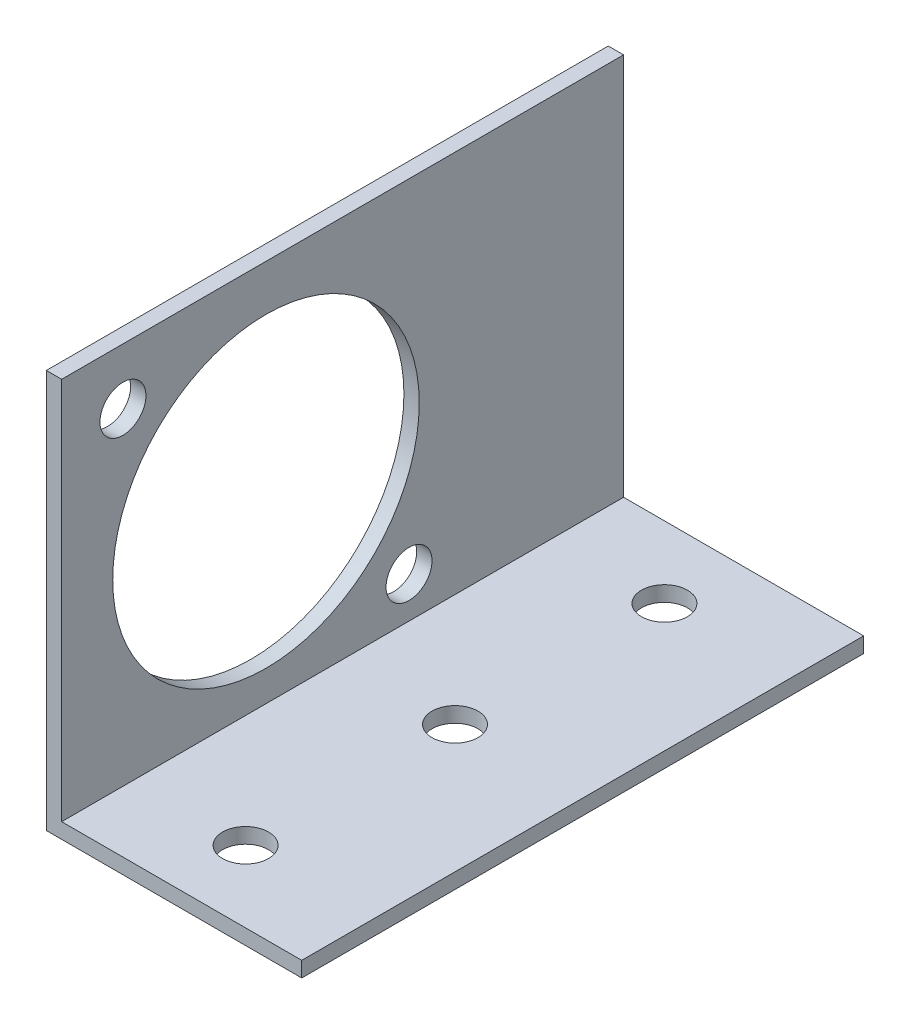
ISO-10303-21;
HEADER;
FILE_DESCRIPTION(('STEP AP214'),'2;1');
FILE_NAME('part.step','',(''),(''),'','','');
FILE_SCHEMA(('AUTOMOTIVE_DESIGN { 1 0 10303 214 1 1 1 1 }'));
ENDSEC;
DATA;
#1=APPLICATION_CONTEXT('core data for automotive mechanical design processes');
#2=APPLICATION_PROTOCOL_DEFINITION('international standard','automotive_design',2000,#1);
#3=PRODUCT_CONTEXT('',#1,'mechanical');
#4=PRODUCT('Part','Part','',(#3));
#5=PRODUCT_RELATED_PRODUCT_CATEGORY('part','',(#4));
#6=PRODUCT_DEFINITION_FORMATION('','',#4);
#7=PRODUCT_DEFINITION_CONTEXT('part definition',#1,'design');
#8=PRODUCT_DEFINITION('design','',#6,#7);
#9=PRODUCT_DEFINITION_SHAPE('','',#8);
#10=(LENGTH_UNIT() NAMED_UNIT(*) SI_UNIT(.MILLI.,.METRE.));
#11=(NAMED_UNIT(*) PLANE_ANGLE_UNIT() SI_UNIT($,.RADIAN.));
#12=(NAMED_UNIT(*) SI_UNIT($,.STERADIAN.) SOLID_ANGLE_UNIT());
#13=UNCERTAINTY_MEASURE_WITH_UNIT(LENGTH_MEASURE(1.E-05),#10,'distance_accuracy_value','');
#14=(GEOMETRIC_REPRESENTATION_CONTEXT(3) GLOBAL_UNCERTAINTY_ASSIGNED_CONTEXT((#13)) GLOBAL_UNIT_ASSIGNED_CONTEXT((#10,
#11,#12)) REPRESENTATION_CONTEXT('',''));
#15=CARTESIAN_POINT('',(0.,0.,0.));
#16=DIRECTION('',(0.,0.,1.));
#17=DIRECTION('',(1.,0.,0.));
#18=AXIS2_PLACEMENT_3D('',#15,#16,#17);
#19=CARTESIAN_POINT('',(1.5,0.,-55.));
#20=DIRECTION('',(1.,0.,0.));
#21=DIRECTION('',(0.,0.,-1.));
#22=AXIS2_PLACEMENT_3D('',#19,#20,#21);
#23=PLANE('',#22);
#24=CARTESIAN_POINT('',(1.5,19.5,-20.));
#25=DIRECTION('',(1.,0.,0.));
#26=DIRECTION('',(0.,0.,-1.));
#27=AXIS2_PLACEMENT_3D('',#24,#25,#26);
#28=CIRCLE('',#27,15.);
#29=CARTESIAN_POINT('',(1.5,19.5,-35.));
#30=VERTEX_POINT('',#29);
#31=EDGE_CURVE('E199',#30,#30,#28,.T.);
#32=ORIENTED_EDGE('',*,*,#31,.F.);
#33=EDGE_LOOP('',(#32));
#34=FACE_BOUND('',#33,.T.);
#35=CARTESIAN_POINT('',(1.5,33.5,-6.));
#36=DIRECTION('',(1.,0.,0.));
#37=DIRECTION('',(0.,0.,-1.));
#38=AXIS2_PLACEMENT_3D('',#35,#36,#37);
#39=CIRCLE('',#38,2.25);
#40=CARTESIAN_POINT('',(1.5,33.5,-8.25));
#41=VERTEX_POINT('',#40);
#42=EDGE_CURVE('E201',#41,#41,#39,.T.);
#43=ORIENTED_EDGE('',*,*,#42,.F.);
#44=EDGE_LOOP('',(#43));
#45=FACE_BOUND('',#44,.T.);
#46=CARTESIAN_POINT('',(1.5,5.5,-34.));
#47=DIRECTION('',(1.,0.,0.));
#48=DIRECTION('',(0.,0.,-1.));
#49=AXIS2_PLACEMENT_3D('',#46,#47,#48);
#50=CIRCLE('',#49,2.25);
#51=CARTESIAN_POINT('',(1.5,5.5,-36.25));
#52=VERTEX_POINT('',#51);
#53=EDGE_CURVE('E209',#52,#52,#50,.T.);
#54=ORIENTED_EDGE('',*,*,#53,.F.);
#55=EDGE_LOOP('',(#54));
#56=FACE_BOUND('',#55,.T.);
#57=DIRECTION('',(0.,1.,0.));
#58=VECTOR('',#57,1.);
#59=CARTESIAN_POINT('',(1.5,0.,0.));
#60=LINE('',#59,#58);
#61=CARTESIAN_POINT('',(1.5,1.5,0.));
#62=VERTEX_POINT('',#61);
#63=CARTESIAN_POINT('',(1.5,39.,0.));
#64=VERTEX_POINT('',#63);
#65=EDGE_CURVE('E113',#62,#64,#60,.T.);
#66=ORIENTED_EDGE('',*,*,#65,.F.);
#67=DIRECTION('',(0.,0.,1.));
#68=VECTOR('',#67,1.);
#69=CARTESIAN_POINT('',(1.5,1.5,-55.));
#70=LINE('',#69,#68);
#71=CARTESIAN_POINT('',(1.5,1.5,-55.));
#72=VERTEX_POINT('',#71);
#73=EDGE_CURVE('E11',#72,#62,#70,.T.);
#74=ORIENTED_EDGE('',*,*,#73,.F.);
#75=DIRECTION('',(0.,1.,0.));
#76=VECTOR('',#75,1.);
#77=CARTESIAN_POINT('',(1.5,0.,-55.));
#78=LINE('',#77,#76);
#79=CARTESIAN_POINT('',(1.5,39.,-55.));
#80=VERTEX_POINT('',#79);
#81=EDGE_CURVE('E127',#72,#80,#78,.T.);
#82=ORIENTED_EDGE('',*,*,#81,.T.);
#83=DIRECTION('',(0.,0.,1.));
#84=VECTOR('',#83,1.);
#85=CARTESIAN_POINT('',(1.5,39.,-55.));
#86=LINE('',#85,#84);
#87=EDGE_CURVE('E34',#80,#64,#86,.T.);
#88=ORIENTED_EDGE('',*,*,#87,.T.);
#89=EDGE_LOOP('',(#66,#74,#82,#88));
#90=FACE_BOUND('',#89,.T.);
#91=ADVANCED_FACE('F31',(#34,#45,#56,#90),#23,.T.);
#92=CARTESIAN_POINT('',(0.,1.5,-55.));
#93=DIRECTION('',(0.,1.,0.));
#94=DIRECTION('',(0.,0.,1.));
#95=AXIS2_PLACEMENT_3D('',#92,#93,#94);
#96=PLANE('',#95);
#97=CARTESIAN_POINT('',(12.5,1.5,-7.));
#98=DIRECTION('',(0.,1.,0.));
#99=DIRECTION('',(0.,0.,1.));
#100=AXIS2_PLACEMENT_3D('',#97,#98,#99);
#101=CIRCLE('',#100,2.25);
#102=CARTESIAN_POINT('',(12.5,1.5,-4.75));
#103=VERTEX_POINT('',#102);
#104=EDGE_CURVE('E215',#103,#103,#101,.T.);
#105=ORIENTED_EDGE('',*,*,#104,.F.);
#106=EDGE_LOOP('',(#105));
#107=FACE_BOUND('',#106,.T.);
#108=CARTESIAN_POINT('',(12.5,1.5,-27.5));
#109=DIRECTION('',(0.,1.,0.));
#110=DIRECTION('',(0.,0.,1.));
#111=AXIS2_PLACEMENT_3D('',#108,#109,#110);
#112=CIRCLE('',#111,2.25);
#113=CARTESIAN_POINT('',(12.5,1.5,-25.25));
#114=VERTEX_POINT('',#113);
#115=EDGE_CURVE('E221',#114,#114,#112,.T.);
#116=ORIENTED_EDGE('',*,*,#115,.F.);
#117=EDGE_LOOP('',(#116));
#118=FACE_BOUND('',#117,.T.);
#119=CARTESIAN_POINT('',(12.5,1.5,-48.));
#120=DIRECTION('',(0.,1.,0.));
#121=DIRECTION('',(0.,0.,1.));
#122=AXIS2_PLACEMENT_3D('',#119,#120,#121);
#123=CIRCLE('',#122,2.25);
#124=CARTESIAN_POINT('',(12.5,1.5,-45.75));
#125=VERTEX_POINT('',#124);
#126=EDGE_CURVE('E227',#125,#125,#123,.T.);
#127=ORIENTED_EDGE('',*,*,#126,.F.);
#128=EDGE_LOOP('',(#127));
#129=FACE_BOUND('',#128,.T.);
#130=DIRECTION('',(1.,0.,0.));
#131=VECTOR('',#130,1.);
#132=CARTESIAN_POINT('',(0.,1.5,0.));
#133=LINE('',#132,#131);
#134=CARTESIAN_POINT('',(25.,1.5,0.));
#135=VERTEX_POINT('',#134);
#136=EDGE_CURVE('E125',#135,#62,#133,.F.);
#137=ORIENTED_EDGE('',*,*,#136,.F.);
#138=DIRECTION('',(0.,0.,1.));
#139=VECTOR('',#138,1.);
#140=CARTESIAN_POINT('',(25.,1.5,-55.));
#141=LINE('',#140,#139);
#142=CARTESIAN_POINT('',(25.,1.5,-55.));
#143=VERTEX_POINT('',#142);
#144=EDGE_CURVE('E40',#143,#135,#141,.T.);
#145=ORIENTED_EDGE('',*,*,#144,.F.);
#146=DIRECTION('',(1.,0.,0.));
#147=VECTOR('',#146,1.);
#148=CARTESIAN_POINT('',(0.,1.5,-55.));
#149=LINE('',#148,#147);
#150=EDGE_CURVE('E94',#143,#72,#149,.F.);
#151=ORIENTED_EDGE('',*,*,#150,.T.);
#152=ORIENTED_EDGE('',*,*,#73,.T.);
#153=EDGE_LOOP('',(#137,#145,#151,#152));
#154=FACE_BOUND('',#153,.T.);
#155=ADVANCED_FACE('F139',(#107,#118,#129,#154),#96,.T.);
#156=CARTESIAN_POINT('',(25.,1.5,-55.));
#157=DIRECTION('',(-1.,0.,0.));
#158=DIRECTION('',(0.,0.,1.));
#159=AXIS2_PLACEMENT_3D('',#156,#157,#158);
#160=PLANE('',#159);
#161=DIRECTION('',(0.,-1.,0.));
#162=VECTOR('',#161,1.);
#163=CARTESIAN_POINT('',(25.,1.5,0.));
#164=LINE('',#163,#162);
#165=CARTESIAN_POINT('',(25.,0.,0.));
#166=VERTEX_POINT('',#165);
#167=EDGE_CURVE('E99',#135,#166,#164,.T.);
#168=ORIENTED_EDGE('',*,*,#167,.T.);
#169=DIRECTION('',(0.,0.,1.));
#170=VECTOR('',#169,1.);
#171=CARTESIAN_POINT('',(25.,0.,-55.));
#172=LINE('',#171,#170);
#173=CARTESIAN_POINT('',(25.,0.,-55.));
#174=VERTEX_POINT('',#173);
#175=EDGE_CURVE('E97',#174,#166,#172,.T.);
#176=ORIENTED_EDGE('',*,*,#175,.F.);
#177=DIRECTION('',(0.,-1.,0.));
#178=VECTOR('',#177,1.);
#179=CARTESIAN_POINT('',(25.,1.5,-55.));
#180=LINE('',#179,#178);
#181=EDGE_CURVE('E88',#143,#174,#180,.T.);
#182=ORIENTED_EDGE('',*,*,#181,.F.);
#183=ORIENTED_EDGE('',*,*,#144,.T.);
#184=EDGE_LOOP('',(#168,#176,#182,#183));
#185=FACE_BOUND('',#184,.T.);
#186=ADVANCED_FACE('F98',(#185),#160,.F.);
#187=CARTESIAN_POINT('',(0.,0.,-55.));
#188=DIRECTION('',(0.,1.,0.));
#189=DIRECTION('',(0.,0.,1.));
#190=AXIS2_PLACEMENT_3D('',#187,#188,#189);
#191=PLANE('',#190);
#192=CARTESIAN_POINT('',(12.5,0.,-7.));
#193=DIRECTION('',(0.,1.,0.));
#194=DIRECTION('',(0.,0.,1.));
#195=AXIS2_PLACEMENT_3D('',#192,#193,#194);
#196=CIRCLE('',#195,2.25);
#197=CARTESIAN_POINT('',(12.5,0.,-4.75));
#198=VERTEX_POINT('',#197);
#199=EDGE_CURVE('E218',#198,#198,#196,.T.);
#200=ORIENTED_EDGE('',*,*,#199,.T.);
#201=EDGE_LOOP('',(#200));
#202=FACE_BOUND('',#201,.T.);
#203=CARTESIAN_POINT('',(12.5,0.,-27.5));
#204=DIRECTION('',(0.,1.,0.));
#205=DIRECTION('',(0.,0.,1.));
#206=AXIS2_PLACEMENT_3D('',#203,#204,#205);
#207=CIRCLE('',#206,2.25);
#208=CARTESIAN_POINT('',(12.5,0.,-25.25));
#209=VERTEX_POINT('',#208);
#210=EDGE_CURVE('E224',#209,#209,#207,.T.);
#211=ORIENTED_EDGE('',*,*,#210,.T.);
#212=EDGE_LOOP('',(#211));
#213=FACE_BOUND('',#212,.T.);
#214=CARTESIAN_POINT('',(12.5,0.,-48.));
#215=DIRECTION('',(0.,1.,0.));
#216=DIRECTION('',(0.,0.,1.));
#217=AXIS2_PLACEMENT_3D('',#214,#215,#216);
#218=CIRCLE('',#217,2.25);
#219=CARTESIAN_POINT('',(12.5,0.,-45.75));
#220=VERTEX_POINT('',#219);
#221=EDGE_CURVE('E117',#220,#220,#218,.T.);
#222=ORIENTED_EDGE('',*,*,#221,.T.);
#223=EDGE_LOOP('',(#222));
#224=FACE_BOUND('',#223,.T.);
#225=DIRECTION('',(-1.,0.,0.));
#226=VECTOR('',#225,1.);
#227=CARTESIAN_POINT('',(0.,0.,0.));
#228=LINE('',#227,#226);
#229=CARTESIAN_POINT('',(0.,0.,0.));
#230=VERTEX_POINT('',#229);
#231=EDGE_CURVE('E122',#166,#230,#228,.T.);
#232=ORIENTED_EDGE('',*,*,#231,.T.);
#233=DIRECTION('',(0.,0.,1.));
#234=VECTOR('',#233,1.);
#235=CARTESIAN_POINT('',(0.,0.,-55.));
#236=LINE('',#235,#234);
#237=CARTESIAN_POINT('',(0.,0.,-55.));
#238=VERTEX_POINT('',#237);
#239=EDGE_CURVE('E102',#238,#230,#236,.T.);
#240=ORIENTED_EDGE('',*,*,#239,.F.);
#241=DIRECTION('',(-1.,0.,0.));
#242=VECTOR('',#241,1.);
#243=CARTESIAN_POINT('',(0.,0.,-55.));
#244=LINE('',#243,#242);
#245=EDGE_CURVE('E92',#174,#238,#244,.T.);
#246=ORIENTED_EDGE('',*,*,#245,.F.);
#247=ORIENTED_EDGE('',*,*,#175,.T.);
#248=EDGE_LOOP('',(#232,#240,#246,#247));
#249=FACE_BOUND('',#248,.T.);
#250=ADVANCED_FACE('F104',(#202,#213,#224,#249),#191,.F.);
#251=CARTESIAN_POINT('',(0.,0.,-55.));
#252=DIRECTION('',(1.,0.,0.));
#253=DIRECTION('',(0.,0.,-1.));
#254=AXIS2_PLACEMENT_3D('',#251,#252,#253);
#255=PLANE('',#254);
#256=CARTESIAN_POINT('',(0.,19.5,-20.));
#257=DIRECTION('',(1.,0.,0.));
#258=DIRECTION('',(0.,0.,-1.));
#259=AXIS2_PLACEMENT_3D('',#256,#257,#258);
#260=CIRCLE('',#259,15.);
#261=CARTESIAN_POINT('',(0.,19.5,-35.));
#262=VERTEX_POINT('',#261);
#263=EDGE_CURVE('E196',#262,#262,#260,.T.);
#264=ORIENTED_EDGE('',*,*,#263,.T.);
#265=EDGE_LOOP('',(#264));
#266=FACE_BOUND('',#265,.T.);
#267=CARTESIAN_POINT('',(0.,33.5,-6.));
#268=DIRECTION('',(1.,0.,0.));
#269=DIRECTION('',(0.,0.,-1.));
#270=AXIS2_PLACEMENT_3D('',#267,#268,#269);
#271=CIRCLE('',#270,2.25);
#272=CARTESIAN_POINT('',(0.,33.5,-8.25));
#273=VERTEX_POINT('',#272);
#274=EDGE_CURVE('E206',#273,#273,#271,.T.);
#275=ORIENTED_EDGE('',*,*,#274,.T.);
#276=EDGE_LOOP('',(#275));
#277=FACE_BOUND('',#276,.T.);
#278=CARTESIAN_POINT('',(0.,5.5,-34.));
#279=DIRECTION('',(1.,0.,0.));
#280=DIRECTION('',(0.,0.,-1.));
#281=AXIS2_PLACEMENT_3D('',#278,#279,#280);
#282=CIRCLE('',#281,2.25);
#283=CARTESIAN_POINT('',(0.,5.5,-36.25));
#284=VERTEX_POINT('',#283);
#285=EDGE_CURVE('E212',#284,#284,#282,.T.);
#286=ORIENTED_EDGE('',*,*,#285,.T.);
#287=EDGE_LOOP('',(#286));
#288=FACE_BOUND('',#287,.T.);
#289=DIRECTION('',(0.,1.,0.));
#290=VECTOR('',#289,1.);
#291=CARTESIAN_POINT('',(0.,0.,0.));
#292=LINE('',#291,#290);
#293=CARTESIAN_POINT('',(0.,39.,0.));
#294=VERTEX_POINT('',#293);
#295=EDGE_CURVE('E120',#230,#294,#292,.T.);
#296=ORIENTED_EDGE('',*,*,#295,.T.);
#297=DIRECTION('',(0.,0.,1.));
#298=VECTOR('',#297,1.);
#299=CARTESIAN_POINT('',(0.,39.,-55.));
#300=LINE('',#299,#298);
#301=CARTESIAN_POINT('',(0.,39.,-55.));
#302=VERTEX_POINT('',#301);
#303=EDGE_CURVE('E130',#302,#294,#300,.T.);
#304=ORIENTED_EDGE('',*,*,#303,.F.);
#305=DIRECTION('',(0.,1.,0.));
#306=VECTOR('',#305,1.);
#307=CARTESIAN_POINT('',(0.,0.,-55.));
#308=LINE('',#307,#306);
#309=EDGE_CURVE('E107',#238,#302,#308,.T.);
#310=ORIENTED_EDGE('',*,*,#309,.F.);
#311=ORIENTED_EDGE('',*,*,#239,.T.);
#312=EDGE_LOOP('',(#296,#304,#310,#311));
#313=FACE_BOUND('',#312,.T.);
#314=ADVANCED_FACE('F156',(#266,#277,#288,#313),#255,.F.);
#315=CARTESIAN_POINT('',(0.,39.,-55.));
#316=DIRECTION('',(0.,-1.,0.));
#317=DIRECTION('',(0.,0.,-1.));
#318=AXIS2_PLACEMENT_3D('',#315,#316,#317);
#319=PLANE('',#318);
#320=DIRECTION('',(1.,0.,0.));
#321=VECTOR('',#320,1.);
#322=CARTESIAN_POINT('',(0.,39.,0.));
#323=LINE('',#322,#321);
#324=EDGE_CURVE('E116',#294,#64,#323,.T.);
#325=ORIENTED_EDGE('',*,*,#324,.T.);
#326=ORIENTED_EDGE('',*,*,#87,.F.);
#327=DIRECTION('',(1.,0.,0.));
#328=VECTOR('',#327,1.);
#329=CARTESIAN_POINT('',(0.,39.,-55.));
#330=LINE('',#329,#328);
#331=EDGE_CURVE('E80',#302,#80,#330,.T.);
#332=ORIENTED_EDGE('',*,*,#331,.F.);
#333=ORIENTED_EDGE('',*,*,#303,.T.);
#334=EDGE_LOOP('',(#325,#326,#332,#333));
#335=FACE_BOUND('',#334,.T.);
#336=ADVANCED_FACE('F135',(#335),#319,.F.);
#337=CARTESIAN_POINT('',(1.5,39.,-55.));
#338=DIRECTION('',(0.,0.,-1.));
#339=DIRECTION('',(-1.,0.,0.));
#340=AXIS2_PLACEMENT_3D('',#337,#338,#339);
#341=PLANE('',#340);
#342=ORIENTED_EDGE('',*,*,#81,.F.);
#343=ORIENTED_EDGE('',*,*,#150,.F.);
#344=ORIENTED_EDGE('',*,*,#181,.T.);
#345=ORIENTED_EDGE('',*,*,#245,.T.);
#346=ORIENTED_EDGE('',*,*,#309,.T.);
#347=ORIENTED_EDGE('',*,*,#331,.T.);
#348=EDGE_LOOP('',(#342,#343,#344,#345,#346,#347));
#349=FACE_BOUND('',#348,.T.);
#350=ADVANCED_FACE('F90',(#349),#341,.T.);
#351=CARTESIAN_POINT('',(1.5,39.,0.));
#352=DIRECTION('',(0.,0.,-1.));
#353=DIRECTION('',(-1.,0.,0.));
#354=AXIS2_PLACEMENT_3D('',#351,#352,#353);
#355=PLANE('',#354);
#356=ORIENTED_EDGE('',*,*,#65,.T.);
#357=ORIENTED_EDGE('',*,*,#324,.F.);
#358=ORIENTED_EDGE('',*,*,#295,.F.);
#359=ORIENTED_EDGE('',*,*,#231,.F.);
#360=ORIENTED_EDGE('',*,*,#167,.F.);
#361=ORIENTED_EDGE('',*,*,#136,.T.);
#362=EDGE_LOOP('',(#356,#357,#358,#359,#360,#361));
#363=FACE_BOUND('',#362,.T.);
#364=ADVANCED_FACE('F138',(#363),#355,.F.);
#365=CARTESIAN_POINT('',(12.5,1.5,-48.));
#366=DIRECTION('',(0.,1.,0.));
#367=DIRECTION('',(0.,0.,1.));
#368=AXIS2_PLACEMENT_3D('',#365,#366,#367);
#369=CYLINDRICAL_SURFACE('',#368,2.25);
#370=ORIENTED_EDGE('',*,*,#221,.F.);
#371=EDGE_LOOP('',(#370));
#372=FACE_BOUND('',#371,.T.);
#373=ORIENTED_EDGE('',*,*,#126,.T.);
#374=EDGE_LOOP('',(#373));
#375=FACE_BOUND('',#374,.T.);
#376=ADVANCED_FACE('F167',(#372,#375),#369,.F.);
#377=CARTESIAN_POINT('',(12.5,1.5,-27.5));
#378=DIRECTION('',(0.,1.,0.));
#379=DIRECTION('',(0.,0.,1.));
#380=AXIS2_PLACEMENT_3D('',#377,#378,#379);
#381=CYLINDRICAL_SURFACE('',#380,2.25);
#382=ORIENTED_EDGE('',*,*,#210,.F.);
#383=EDGE_LOOP('',(#382));
#384=FACE_BOUND('',#383,.T.);
#385=ORIENTED_EDGE('',*,*,#115,.T.);
#386=EDGE_LOOP('',(#385));
#387=FACE_BOUND('',#386,.T.);
#388=ADVANCED_FACE('F171',(#384,#387),#381,.F.);
#389=CARTESIAN_POINT('',(12.5,1.5,-7.));
#390=DIRECTION('',(0.,1.,0.));
#391=DIRECTION('',(0.,0.,1.));
#392=AXIS2_PLACEMENT_3D('',#389,#390,#391);
#393=CYLINDRICAL_SURFACE('',#392,2.25);
#394=ORIENTED_EDGE('',*,*,#199,.F.);
#395=EDGE_LOOP('',(#394));
#396=FACE_BOUND('',#395,.T.);
#397=ORIENTED_EDGE('',*,*,#104,.T.);
#398=EDGE_LOOP('',(#397));
#399=FACE_BOUND('',#398,.T.);
#400=ADVANCED_FACE('F175',(#396,#399),#393,.F.);
#401=CARTESIAN_POINT('',(1.5,5.5,-34.));
#402=DIRECTION('',(1.,0.,0.));
#403=DIRECTION('',(0.,0.,-1.));
#404=AXIS2_PLACEMENT_3D('',#401,#402,#403);
#405=CYLINDRICAL_SURFACE('',#404,2.25);
#406=ORIENTED_EDGE('',*,*,#285,.F.);
#407=EDGE_LOOP('',(#406));
#408=FACE_BOUND('',#407,.T.);
#409=ORIENTED_EDGE('',*,*,#53,.T.);
#410=EDGE_LOOP('',(#409));
#411=FACE_BOUND('',#410,.T.);
#412=ADVANCED_FACE('F179',(#408,#411),#405,.F.);
#413=CARTESIAN_POINT('',(1.5,33.5,-6.));
#414=DIRECTION('',(1.,0.,0.));
#415=DIRECTION('',(0.,0.,-1.));
#416=AXIS2_PLACEMENT_3D('',#413,#414,#415);
#417=CYLINDRICAL_SURFACE('',#416,2.25);
#418=ORIENTED_EDGE('',*,*,#274,.F.);
#419=EDGE_LOOP('',(#418));
#420=FACE_BOUND('',#419,.T.);
#421=ORIENTED_EDGE('',*,*,#42,.T.);
#422=EDGE_LOOP('',(#421));
#423=FACE_BOUND('',#422,.T.);
#424=ADVANCED_FACE('F183',(#420,#423),#417,.F.);
#425=CARTESIAN_POINT('',(1.5,19.5,-20.));
#426=DIRECTION('',(1.,0.,0.));
#427=DIRECTION('',(0.,0.,-1.));
#428=AXIS2_PLACEMENT_3D('',#425,#426,#427);
#429=CYLINDRICAL_SURFACE('',#428,15.);
#430=ORIENTED_EDGE('',*,*,#263,.F.);
#431=EDGE_LOOP('',(#430));
#432=FACE_BOUND('',#431,.T.);
#433=ORIENTED_EDGE('',*,*,#31,.T.);
#434=EDGE_LOOP('',(#433));
#435=FACE_BOUND('',#434,.T.);
#436=ADVANCED_FACE('F187',(#432,#435),#429,.F.);
#437=CLOSED_SHELL('',(#91,#155,#186,#250,#314,#336,#350,#364,#376,#388,#400,#412,#424,#436));
#438=MANIFOLD_SOLID_BREP('B2',#437);
#439=ADVANCED_BREP_SHAPE_REPRESENTATION('',(#18,#438),#14);
#440=SHAPE_DEFINITION_REPRESENTATION(#9,#439);
ENDSEC;
END-ISO-10303-21;
